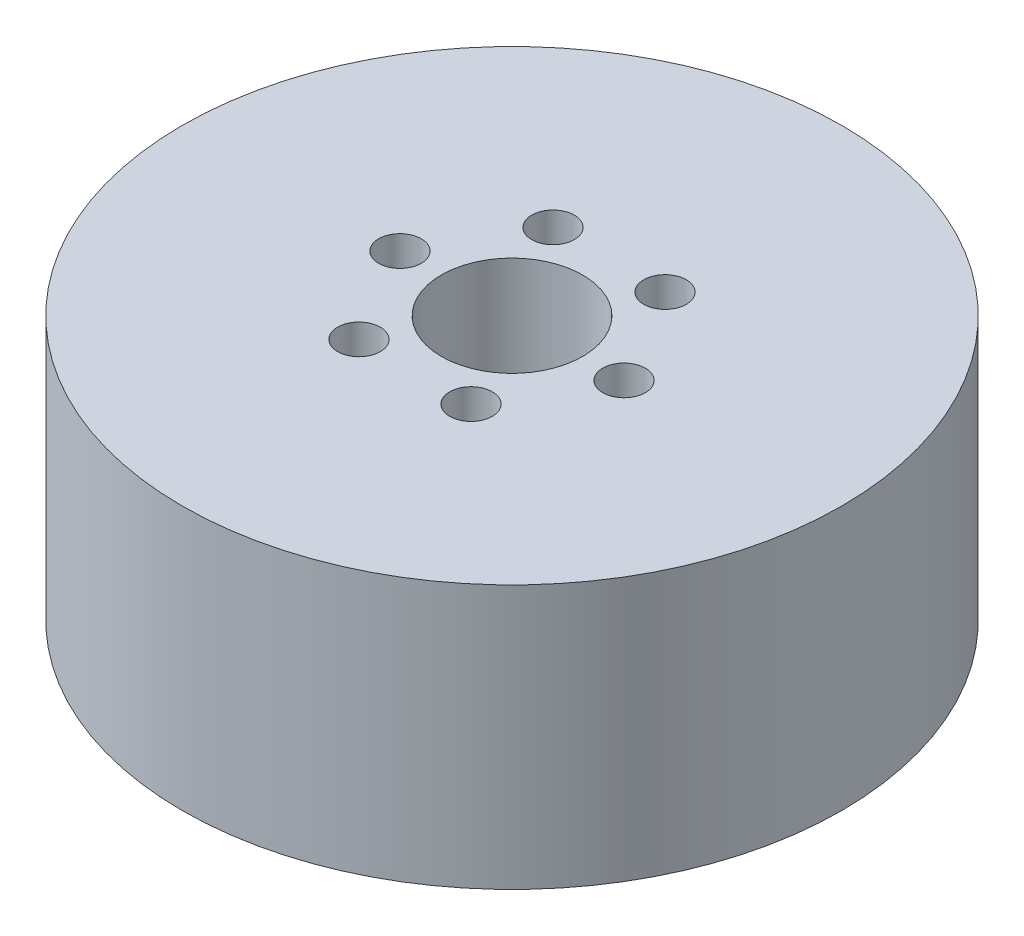
ISO-10303-21;
HEADER;
FILE_DESCRIPTION(('STEP AP214'),'2;1');
FILE_NAME('part.step','',(''),(''),'','','');
FILE_SCHEMA(('AUTOMOTIVE_DESIGN { 1 0 10303 214 1 1 1 1 }'));
ENDSEC;
DATA;
#1=APPLICATION_CONTEXT('core data for automotive mechanical design processes');
#2=APPLICATION_PROTOCOL_DEFINITION('international standard','automotive_design',2000,#1);
#3=PRODUCT_CONTEXT('',#1,'mechanical');
#4=PRODUCT('Part','Part','',(#3));
#5=PRODUCT_RELATED_PRODUCT_CATEGORY('part','',(#4));
#6=PRODUCT_DEFINITION_FORMATION('','',#4);
#7=PRODUCT_DEFINITION_CONTEXT('part definition',#1,'design');
#8=PRODUCT_DEFINITION('design','',#6,#7);
#9=PRODUCT_DEFINITION_SHAPE('','',#8);
#10=(LENGTH_UNIT() NAMED_UNIT(*) SI_UNIT(.MILLI.,.METRE.));
#11=(NAMED_UNIT(*) PLANE_ANGLE_UNIT() SI_UNIT($,.RADIAN.));
#12=(NAMED_UNIT(*) SI_UNIT($,.STERADIAN.) SOLID_ANGLE_UNIT());
#13=UNCERTAINTY_MEASURE_WITH_UNIT(LENGTH_MEASURE(1.E-05),#10,'distance_accuracy_value','');
#14=(GEOMETRIC_REPRESENTATION_CONTEXT(3) GLOBAL_UNCERTAINTY_ASSIGNED_CONTEXT((#13)) GLOBAL_UNIT_ASSIGNED_CONTEXT((#10,
#11,#12)) REPRESENTATION_CONTEXT('',''));
#15=CARTESIAN_POINT('',(0.,0.,0.));
#16=DIRECTION('',(0.,0.,1.));
#17=DIRECTION('',(1.,0.,0.));
#18=AXIS2_PLACEMENT_3D('',#15,#16,#17);
#19=CARTESIAN_POINT('',(0.,28.,0.));
#20=DIRECTION('',(0.,-1.,0.));
#21=DIRECTION('',(0.,0.,-1.));
#22=AXIS2_PLACEMENT_3D('',#19,#20,#21);
#23=CYLINDRICAL_SURFACE('',#22,35.);
#24=CARTESIAN_POINT('',(0.,28.,0.));
#25=DIRECTION('',(0.,1.,0.));
#26=DIRECTION('',(0.,0.,1.));
#27=AXIS2_PLACEMENT_3D('',#24,#25,#26);
#28=CIRCLE('',#27,35.);
#29=CARTESIAN_POINT('',(0.,28.,35.));
#30=VERTEX_POINT('',#29);
#31=EDGE_CURVE('E10',#30,#30,#28,.T.);
#32=ORIENTED_EDGE('',*,*,#31,.F.);
#33=EDGE_LOOP('',(#32));
#34=FACE_BOUND('',#33,.T.);
#35=CARTESIAN_POINT('',(0.,0.,0.));
#36=DIRECTION('',(0.,1.,0.));
#37=DIRECTION('',(0.,0.,1.));
#38=AXIS2_PLACEMENT_3D('',#35,#36,#37);
#39=CIRCLE('',#38,35.);
#40=CARTESIAN_POINT('',(0.,0.,35.));
#41=VERTEX_POINT('',#40);
#42=EDGE_CURVE('E37',#41,#41,#39,.T.);
#43=ORIENTED_EDGE('',*,*,#42,.T.);
#44=EDGE_LOOP('',(#43));
#45=FACE_BOUND('',#44,.T.);
#46=ADVANCED_FACE('F40',(#34,#45),#23,.T.);
#47=CARTESIAN_POINT('',(0.,28.,0.));
#48=DIRECTION('',(0.,1.,0.));
#49=DIRECTION('',(0.,0.,1.));
#50=AXIS2_PLACEMENT_3D('',#47,#48,#49);
#51=PLANE('',#50);
#52=CARTESIAN_POINT('',(-5.94638625213495,28.,-10.2994431101265));
#53=DIRECTION('',(0.,1.,0.));
#54=DIRECTION('',(-0.866025403784433,0.,0.50000000000001));
#55=AXIS2_PLACEMENT_3D('',#52,#53,#54);
#56=CIRCLE('',#55,2.26116094121226);
#57=CARTESIAN_POINT('',(-5.94638625213495,28.,-8.03828216891428));
#58=VERTEX_POINT('',#57);
#59=EDGE_CURVE('E70',#58,#58,#56,.T.);
#60=ORIENTED_EDGE('',*,*,#59,.F.);
#61=EDGE_LOOP('',(#60));
#62=FACE_BOUND('',#61,.T.);
#63=CARTESIAN_POINT('',(5.94638625213474,28.,-10.2994431101267));
#64=DIRECTION('',(0.,1.,0.));
#65=DIRECTION('',(-0.866025403784443,0.,-0.499999999999992));
#66=AXIS2_PLACEMENT_3D('',#63,#64,#65);
#67=CIRCLE('',#66,2.26116094121226);
#68=CARTESIAN_POINT('',(5.94638625213474,28.,-8.0382821689144));
#69=VERTEX_POINT('',#68);
#70=EDGE_CURVE('E71',#69,#69,#67,.T.);
#71=ORIENTED_EDGE('',*,*,#70,.F.);
#72=EDGE_LOOP('',(#71));
#73=FACE_BOUND('',#72,.T.);
#74=CARTESIAN_POINT('',(11.8927725042697,28.,0.));
#75=DIRECTION('',(0.,1.,0.));
#76=DIRECTION('',(0.,0.,-1.));
#77=AXIS2_PLACEMENT_3D('',#74,#75,#76);
#78=CIRCLE('',#77,2.26116094121226);
#79=CARTESIAN_POINT('',(11.8927725042697,28.,2.26116094121226));
#80=VERTEX_POINT('',#79);
#81=EDGE_CURVE('E78',#80,#80,#78,.T.);
#82=ORIENTED_EDGE('',*,*,#81,.F.);
#83=EDGE_LOOP('',(#82));
#84=FACE_BOUND('',#83,.T.);
#85=CARTESIAN_POINT('',(5.94638625213488,28.,10.2994431101266));
#86=DIRECTION('',(0.,1.,0.));
#87=DIRECTION('',(0.866025403784436,0.,-0.500000000000004));
#88=AXIS2_PLACEMENT_3D('',#85,#86,#87);
#89=CIRCLE('',#88,2.26116094121226);
#90=CARTESIAN_POINT('',(5.94638625213488,28.,12.5606040513388));
#91=VERTEX_POINT('',#90);
#92=EDGE_CURVE('E84',#91,#91,#89,.T.);
#93=ORIENTED_EDGE('',*,*,#92,.F.);
#94=EDGE_LOOP('',(#93));
#95=FACE_BOUND('',#94,.T.);
#96=CARTESIAN_POINT('',(-5.94638625213481,28.,10.2994431101266));
#97=DIRECTION('',(0.,1.,0.));
#98=DIRECTION('',(0.86602540378444,0.,0.499999999999998));
#99=AXIS2_PLACEMENT_3D('',#96,#97,#98);
#100=CIRCLE('',#99,2.26116094121226);
#101=CARTESIAN_POINT('',(-5.94638625213481,28.,12.5606040513389));
#102=VERTEX_POINT('',#101);
#103=EDGE_CURVE('E61',#102,#102,#100,.T.);
#104=ORIENTED_EDGE('',*,*,#103,.F.);
#105=EDGE_LOOP('',(#104));
#106=FACE_BOUND('',#105,.T.);
#107=CARTESIAN_POINT('',(-11.8927725042697,28.,0.));
#108=DIRECTION('',(0.,1.,0.));
#109=DIRECTION('',(0.,0.,1.));
#110=AXIS2_PLACEMENT_3D('',#107,#108,#109);
#111=CIRCLE('',#110,2.26116094121226);
#112=CARTESIAN_POINT('',(-11.8927725042697,28.,2.26116094121226));
#113=VERTEX_POINT('',#112);
#114=EDGE_CURVE('E54',#113,#113,#111,.T.);
#115=ORIENTED_EDGE('',*,*,#114,.F.);
#116=EDGE_LOOP('',(#115));
#117=FACE_BOUND('',#116,.T.);
#118=CARTESIAN_POINT('',(0.,28.,0.));
#119=DIRECTION('',(0.,1.,0.));
#120=DIRECTION('',(0.,0.,1.));
#121=AXIS2_PLACEMENT_3D('',#118,#119,#120);
#122=CIRCLE('',#121,7.5);
#123=CARTESIAN_POINT('',(0.,28.,7.5));
#124=VERTEX_POINT('',#123);
#125=EDGE_CURVE('E50',#124,#124,#122,.T.);
#126=ORIENTED_EDGE('',*,*,#125,.F.);
#127=EDGE_LOOP('',(#126));
#128=FACE_BOUND('',#127,.T.);
#129=ORIENTED_EDGE('',*,*,#31,.T.);
#130=EDGE_LOOP('',(#129));
#131=FACE_BOUND('',#130,.T.);
#132=ADVANCED_FACE('F99',(#62,#73,#84,#95,#106,#117,#128,#131),#51,.T.);
#133=CARTESIAN_POINT('',(0.,0.,0.));
#134=DIRECTION('',(0.,1.,0.));
#135=DIRECTION('',(0.,0.,1.));
#136=AXIS2_PLACEMENT_3D('',#133,#134,#135);
#137=PLANE('',#136);
#138=CARTESIAN_POINT('',(0.,0.,0.));
#139=DIRECTION('',(0.,1.,0.));
#140=DIRECTION('',(0.,0.,1.));
#141=AXIS2_PLACEMENT_3D('',#138,#139,#140);
#142=CIRCLE('',#141,7.5);
#143=CARTESIAN_POINT('',(0.,0.,7.5));
#144=VERTEX_POINT('',#143);
#145=EDGE_CURVE('E47',#144,#144,#142,.T.);
#146=ORIENTED_EDGE('',*,*,#145,.T.);
#147=EDGE_LOOP('',(#146));
#148=FACE_BOUND('',#147,.T.);
#149=ORIENTED_EDGE('',*,*,#42,.F.);
#150=EDGE_LOOP('',(#149));
#151=FACE_BOUND('',#150,.T.);
#152=ADVANCED_FACE('F103',(#148,#151),#137,.F.);
#153=CARTESIAN_POINT('',(0.,28.,0.));
#154=DIRECTION('',(0.,-1.,0.));
#155=DIRECTION('',(0.,0.,-1.));
#156=AXIS2_PLACEMENT_3D('',#153,#154,#155);
#157=CYLINDRICAL_SURFACE('',#156,7.5);
#158=ORIENTED_EDGE('',*,*,#125,.T.);
#159=EDGE_LOOP('',(#158));
#160=FACE_BOUND('',#159,.T.);
#161=ORIENTED_EDGE('',*,*,#145,.F.);
#162=EDGE_LOOP('',(#161));
#163=FACE_BOUND('',#162,.T.);
#164=ADVANCED_FACE('F115',(#160,#163),#157,.F.);
#165=CARTESIAN_POINT('',(-11.8927725042697,1.96096125977103,0.));
#166=DIRECTION('',(0.,1.,0.));
#167=DIRECTION('',(0.,0.,1.));
#168=AXIS2_PLACEMENT_3D('',#165,#166,#167);
#169=CYLINDRICAL_SURFACE('',#168,2.26116094121226);
#170=CARTESIAN_POINT('',(-11.8927725042697,1.96096125977103,0.));
#171=DIRECTION('',(0.,1.,0.));
#172=DIRECTION('',(0.,0.,1.));
#173=AXIS2_PLACEMENT_3D('',#170,#171,#172);
#174=CIRCLE('',#173,2.26116094121226);
#175=CARTESIAN_POINT('',(-11.8927725042697,1.96096125977103,2.26116094121226));
#176=VERTEX_POINT('',#175);
#177=EDGE_CURVE('E55',#176,#176,#174,.T.);
#178=CARTESIAN_POINT('',(-11.8927725042697,1.96096125977103,2.26116094121226));
#179=CARTESIAN_POINT('',(-11.8927725042697,2.23220124664842,2.26116094121226));
#180=CARTESIAN_POINT('',(-11.8927725042697,2.5034412335258,2.26116094121226));
#181=CARTESIAN_POINT('',(-11.8927725042697,3.04592120728057,2.26116094121226));
#182=CARTESIAN_POINT('',(-11.8927725042697,3.31716119415796,2.26116094121226));
#183=CARTESIAN_POINT('',(-11.8927725042697,3.85964116791273,2.26116094121226));
#184=CARTESIAN_POINT('',(-11.8927725042697,4.13088115479011,2.26116094121226));
#185=CARTESIAN_POINT('',(-11.8927725042697,4.67336112854488,2.26116094121226));
#186=CARTESIAN_POINT('',(-11.8927725042697,4.94460111542227,2.26116094121226));
#187=CARTESIAN_POINT('',(-11.8927725042697,5.48708108917704,2.26116094121226));
#188=CARTESIAN_POINT('',(-11.8927725042697,5.75832107605442,2.26116094121226));
#189=CARTESIAN_POINT('',(-11.8927725042697,6.30080104980919,2.26116094121226));
#190=CARTESIAN_POINT('',(-11.8927725042697,6.57204103668658,2.26116094121226));
#191=CARTESIAN_POINT('',(-11.8927725042697,7.11452101044135,2.26116094121226));
#192=CARTESIAN_POINT('',(-11.8927725042697,7.38576099731873,2.26116094121226));
#193=CARTESIAN_POINT('',(-11.8927725042697,7.9282409710735,2.26116094121226));
#194=CARTESIAN_POINT('',(-11.8927725042697,8.19948095795089,2.26116094121226));
#195=CARTESIAN_POINT('',(-11.8927725042697,8.74196093170566,2.26116094121226));
#196=CARTESIAN_POINT('',(-11.8927725042697,9.01320091858304,2.26116094121226));
#197=CARTESIAN_POINT('',(-11.8927725042697,9.55568089233781,2.26116094121226));
#198=CARTESIAN_POINT('',(-11.8927725042697,9.8269208792152,2.26116094121226));
#199=CARTESIAN_POINT('',(-11.8927725042697,10.36940085297,2.26116094121226));
#200=CARTESIAN_POINT('',(-11.8927725042697,10.6406408398474,2.26116094121226));
#201=CARTESIAN_POINT('',(-11.8927725042697,11.1831208136021,2.26116094121226));
#202=CARTESIAN_POINT('',(-11.8927725042697,11.4543608004795,2.26116094121226));
#203=CARTESIAN_POINT('',(-11.8927725042697,11.9968407742343,2.26116094121226));
#204=CARTESIAN_POINT('',(-11.8927725042697,12.2680807611117,2.26116094121226));
#205=CARTESIAN_POINT('',(-11.8927725042697,12.8105607348664,2.26116094121226));
#206=CARTESIAN_POINT('',(-11.8927725042697,13.0818007217438,2.26116094121226));
#207=CARTESIAN_POINT('',(-11.8927725042697,13.6242806954986,2.26116094121226));
#208=CARTESIAN_POINT('',(-11.8927725042697,13.895520682376,2.26116094121226));
#209=CARTESIAN_POINT('',(-11.8927725042697,14.4380006561307,2.26116094121226));
#210=CARTESIAN_POINT('',(-11.8927725042697,14.7092406430081,2.26116094121226));
#211=CARTESIAN_POINT('',(-11.8927725042697,15.2517206167629,2.26116094121226));
#212=CARTESIAN_POINT('',(-11.8927725042697,15.5229606036403,2.26116094121226));
#213=CARTESIAN_POINT('',(-11.8927725042697,16.0654405773951,2.26116094121226));
#214=CARTESIAN_POINT('',(-11.8927725042697,16.3366805642724,2.26116094121226));
#215=CARTESIAN_POINT('',(-11.8927725042697,16.8791605380272,2.26116094121226));
#216=CARTESIAN_POINT('',(-11.8927725042697,17.1504005249046,2.26116094121226));
#217=CARTESIAN_POINT('',(-11.8927725042697,17.6928804986594,2.26116094121226));
#218=CARTESIAN_POINT('',(-11.8927725042697,17.9641204855367,2.26116094121226));
#219=CARTESIAN_POINT('',(-11.8927725042697,18.5066004592915,2.26116094121226));
#220=CARTESIAN_POINT('',(-11.8927725042697,18.7778404461689,2.26116094121226));
#221=CARTESIAN_POINT('',(-11.8927725042697,19.3203204199237,2.26116094121226));
#222=CARTESIAN_POINT('',(-11.8927725042697,19.5915604068011,2.26116094121226));
#223=CARTESIAN_POINT('',(-11.8927725042697,20.1340403805558,2.26116094121226));
#224=CARTESIAN_POINT('',(-11.8927725042697,20.4052803674332,2.26116094121226));
#225=CARTESIAN_POINT('',(-11.8927725042697,20.947760341188,2.26116094121226));
#226=CARTESIAN_POINT('',(-11.8927725042697,21.2190003280654,2.26116094121226));
#227=CARTESIAN_POINT('',(-11.8927725042697,21.7614803018201,2.26116094121226));
#228=CARTESIAN_POINT('',(-11.8927725042697,22.0327202886975,2.26116094121226));
#229=CARTESIAN_POINT('',(-11.8927725042697,22.5752002624523,2.26116094121226));
#230=CARTESIAN_POINT('',(-11.8927725042697,22.8464402493297,2.26116094121226));
#231=CARTESIAN_POINT('',(-11.8927725042697,23.3889202230845,2.26116094121226));
#232=CARTESIAN_POINT('',(-11.8927725042697,23.6601602099618,2.26116094121226));
#233=CARTESIAN_POINT('',(-11.8927725042697,24.2026401837166,2.26116094121226));
#234=CARTESIAN_POINT('',(-11.8927725042697,24.473880170594,2.26116094121226));
#235=CARTESIAN_POINT('',(-11.8927725042697,25.0163601443488,2.26116094121226));
#236=CARTESIAN_POINT('',(-11.8927725042697,25.2876001312261,2.26116094121226));
#237=CARTESIAN_POINT('',(-11.8927725042697,25.8300801049809,2.26116094121226));
#238=CARTESIAN_POINT('',(-11.8927725042697,26.1013200918583,2.26116094121226));
#239=CARTESIAN_POINT('',(-11.8927725042697,26.6438000656131,2.26116094121226));
#240=CARTESIAN_POINT('',(-11.8927725042697,26.9150400524905,2.26116094121226));
#241=CARTESIAN_POINT('',(-11.8927725042697,27.4575200262452,2.26116094121226));
#242=CARTESIAN_POINT('',(-11.8927725042697,27.7287600131226,2.26116094121226));
#243=CARTESIAN_POINT('',(-11.8927725042697,28.,2.26116094121226));
#244=B_SPLINE_CURVE_WITH_KNOTS('',3,(#178,#179,#180,#181,#182,#183,#184,#185,#186,#187,#188,
#189,#190,#191,#192,#193,#194,#195,#196,#197,#198,#199,#200,#201,#202,#203,#204,#205,#206,#207,
#208,#209,#210,#211,#212,#213,#214,#215,#216,#217,#218,#219,#220,#221,#222,#223,#224,#225,#226,
#227,#228,#229,#230,#231,#232,#233,#234,#235,#236,#237,#238,#239,#240,#241,#242,#243),
.UNSPECIFIED.,.F.,.F.,(4,2,2,2,2,2,2,2,2,2,2,2,2,2,2,2,2,2,2,2,2,2,2,2,2,2,2,2,2,2,2,2,4),(0.,
0.813719960632155,1.62743992126431,2.44115988189647,3.25487984252862,4.06859980316078,
4.88231976379293,5.69603972442509,6.50975968505724,7.3234796456894,8.13719960632155,
8.95091956695371,9.76463952758586,10.578359488218,11.3920794488502,12.2057994094823,
13.0195193701145,13.8332393307466,14.6469592913788,15.4606792520109,16.2743992126431,
17.0881191732753,17.9018391339074,18.7155590945396,19.5292790551717,20.3429990158039,
21.156718976436,21.9704389370682,22.7841588977003,23.5978788583325,24.4115988189647,
25.2253187795968,26.039038740229),.UNSPECIFIED.);
#245=EDGE_CURVE('BSEAM113',#176,#113,#244,.T.);
#246=ORIENTED_EDGE('',*,*,#177,.F.);
#247=ORIENTED_EDGE('',*,*,#114,.T.);
#248=ORIENTED_EDGE('',*,*,#245,.T.);
#249=ORIENTED_EDGE('',*,*,#245,.F.);
#250=EDGE_LOOP('',(#246,#248,#247,#249));
#251=FACE_BOUND('',#250,.T.);
#252=ADVANCED_FACE('F113',(#251),#169,.F.);
#253=CARTESIAN_POINT('',(-11.8927725042697,1.96096125977103,0.));
#254=DIRECTION('',(0.,1.,0.));
#255=DIRECTION('',(0.,0.,1.));
#256=AXIS2_PLACEMENT_3D('',#253,#254,#255);
#257=PLANE('',#256);
#258=ORIENTED_EDGE('',*,*,#177,.T.);
#259=EDGE_LOOP('',(#258));
#260=FACE_BOUND('',#259,.T.);
#261=ADVANCED_FACE('F144',(#260),#257,.T.);
#262=CARTESIAN_POINT('',(-5.94638625213481,1.96096125977103,10.2994431101266));
#263=DIRECTION('',(0.,1.,0.));
#264=DIRECTION('',(0.,0.,1.));
#265=AXIS2_PLACEMENT_3D('',#262,#263,#264);
#266=CYLINDRICAL_SURFACE('',#265,2.26116094121226);
#267=CARTESIAN_POINT('',(-5.94638625213481,1.96096125977103,10.2994431101266));
#268=DIRECTION('',(0.,1.,0.));
#269=DIRECTION('',(0.86602540378444,0.,0.499999999999998));
#270=AXIS2_PLACEMENT_3D('',#267,#268,#269);
#271=CIRCLE('',#270,2.26116094121226);
#272=CARTESIAN_POINT('',(-5.94638625213481,1.96096125977103,12.5606040513389));
#273=VERTEX_POINT('',#272);
#274=EDGE_CURVE('E59',#273,#273,#271,.T.);
#275=CARTESIAN_POINT('',(-5.94638625213481,1.96096125977103,12.5606040513389));
#276=CARTESIAN_POINT('',(-5.94638625213481,2.23220124664842,12.5606040513389));
#277=CARTESIAN_POINT('',(-5.94638625213481,2.5034412335258,12.5606040513389));
#278=CARTESIAN_POINT('',(-5.94638625213481,3.04592120728057,12.5606040513389));
#279=CARTESIAN_POINT('',(-5.94638625213481,3.31716119415796,12.5606040513389));
#280=CARTESIAN_POINT('',(-5.94638625213481,3.85964116791273,12.5606040513389));
#281=CARTESIAN_POINT('',(-5.94638625213481,4.13088115479011,12.5606040513389));
#282=CARTESIAN_POINT('',(-5.94638625213481,4.67336112854488,12.5606040513389));
#283=CARTESIAN_POINT('',(-5.94638625213481,4.94460111542227,12.5606040513389));
#284=CARTESIAN_POINT('',(-5.94638625213481,5.48708108917704,12.5606040513389));
#285=CARTESIAN_POINT('',(-5.94638625213481,5.75832107605442,12.5606040513389));
#286=CARTESIAN_POINT('',(-5.94638625213481,6.30080104980919,12.5606040513389));
#287=CARTESIAN_POINT('',(-5.94638625213481,6.57204103668658,12.5606040513389));
#288=CARTESIAN_POINT('',(-5.94638625213481,7.11452101044135,12.5606040513389));
#289=CARTESIAN_POINT('',(-5.94638625213481,7.38576099731873,12.5606040513389));
#290=CARTESIAN_POINT('',(-5.94638625213481,7.9282409710735,12.5606040513389));
#291=CARTESIAN_POINT('',(-5.94638625213481,8.19948095795089,12.5606040513389));
#292=CARTESIAN_POINT('',(-5.94638625213481,8.74196093170566,12.5606040513389));
#293=CARTESIAN_POINT('',(-5.94638625213481,9.01320091858304,12.5606040513389));
#294=CARTESIAN_POINT('',(-5.94638625213481,9.55568089233781,12.5606040513389));
#295=CARTESIAN_POINT('',(-5.94638625213481,9.8269208792152,12.5606040513389));
#296=CARTESIAN_POINT('',(-5.94638625213481,10.36940085297,12.5606040513389));
#297=CARTESIAN_POINT('',(-5.94638625213481,10.6406408398474,12.5606040513389));
#298=CARTESIAN_POINT('',(-5.94638625213481,11.1831208136021,12.5606040513389));
#299=CARTESIAN_POINT('',(-5.94638625213481,11.4543608004795,12.5606040513389));
#300=CARTESIAN_POINT('',(-5.94638625213481,11.9968407742343,12.5606040513389));
#301=CARTESIAN_POINT('',(-5.94638625213481,12.2680807611117,12.5606040513389));
#302=CARTESIAN_POINT('',(-5.94638625213481,12.8105607348664,12.5606040513389));
#303=CARTESIAN_POINT('',(-5.94638625213481,13.0818007217438,12.5606040513389));
#304=CARTESIAN_POINT('',(-5.94638625213481,13.6242806954986,12.5606040513389));
#305=CARTESIAN_POINT('',(-5.94638625213481,13.895520682376,12.5606040513389));
#306=CARTESIAN_POINT('',(-5.94638625213481,14.4380006561307,12.5606040513389));
#307=CARTESIAN_POINT('',(-5.94638625213481,14.7092406430081,12.5606040513389));
#308=CARTESIAN_POINT('',(-5.94638625213481,15.2517206167629,12.5606040513389));
#309=CARTESIAN_POINT('',(-5.94638625213481,15.5229606036403,12.5606040513389));
#310=CARTESIAN_POINT('',(-5.94638625213481,16.0654405773951,12.5606040513389));
#311=CARTESIAN_POINT('',(-5.94638625213481,16.3366805642724,12.5606040513389));
#312=CARTESIAN_POINT('',(-5.94638625213481,16.8791605380272,12.5606040513389));
#313=CARTESIAN_POINT('',(-5.94638625213481,17.1504005249046,12.5606040513389));
#314=CARTESIAN_POINT('',(-5.94638625213481,17.6928804986594,12.5606040513389));
#315=CARTESIAN_POINT('',(-5.94638625213481,17.9641204855367,12.5606040513389));
#316=CARTESIAN_POINT('',(-5.94638625213481,18.5066004592915,12.5606040513389));
#317=CARTESIAN_POINT('',(-5.94638625213481,18.7778404461689,12.5606040513389));
#318=CARTESIAN_POINT('',(-5.94638625213481,19.3203204199237,12.5606040513389));
#319=CARTESIAN_POINT('',(-5.94638625213481,19.5915604068011,12.5606040513389));
#320=CARTESIAN_POINT('',(-5.94638625213481,20.1340403805558,12.5606040513389));
#321=CARTESIAN_POINT('',(-5.94638625213481,20.4052803674332,12.5606040513389));
#322=CARTESIAN_POINT('',(-5.94638625213481,20.947760341188,12.5606040513389));
#323=CARTESIAN_POINT('',(-5.94638625213481,21.2190003280654,12.5606040513389));
#324=CARTESIAN_POINT('',(-5.94638625213481,21.7614803018201,12.5606040513389));
#325=CARTESIAN_POINT('',(-5.94638625213481,22.0327202886975,12.5606040513389));
#326=CARTESIAN_POINT('',(-5.94638625213481,22.5752002624523,12.5606040513389));
#327=CARTESIAN_POINT('',(-5.94638625213481,22.8464402493297,12.5606040513389));
#328=CARTESIAN_POINT('',(-5.94638625213481,23.3889202230845,12.5606040513389));
#329=CARTESIAN_POINT('',(-5.94638625213481,23.6601602099618,12.5606040513389));
#330=CARTESIAN_POINT('',(-5.94638625213481,24.2026401837166,12.5606040513389));
#331=CARTESIAN_POINT('',(-5.94638625213481,24.473880170594,12.5606040513389));
#332=CARTESIAN_POINT('',(-5.94638625213481,25.0163601443488,12.5606040513389));
#333=CARTESIAN_POINT('',(-5.94638625213481,25.2876001312261,12.5606040513389));
#334=CARTESIAN_POINT('',(-5.94638625213481,25.8300801049809,12.5606040513389));
#335=CARTESIAN_POINT('',(-5.94638625213481,26.1013200918583,12.5606040513389));
#336=CARTESIAN_POINT('',(-5.94638625213481,26.6438000656131,12.5606040513389));
#337=CARTESIAN_POINT('',(-5.94638625213481,26.9150400524905,12.5606040513389));
#338=CARTESIAN_POINT('',(-5.94638625213481,27.4575200262452,12.5606040513389));
#339=CARTESIAN_POINT('',(-5.94638625213481,27.7287600131226,12.5606040513389));
#340=CARTESIAN_POINT('',(-5.94638625213481,28.,12.5606040513389));
#341=B_SPLINE_CURVE_WITH_KNOTS('',3,(#275,#276,#277,#278,#279,#280,#281,#282,#283,#284,#285,
#286,#287,#288,#289,#290,#291,#292,#293,#294,#295,#296,#297,#298,#299,#300,#301,#302,#303,#304,
#305,#306,#307,#308,#309,#310,#311,#312,#313,#314,#315,#316,#317,#318,#319,#320,#321,#322,#323,
#324,#325,#326,#327,#328,#329,#330,#331,#332,#333,#334,#335,#336,#337,#338,#339,#340),
.UNSPECIFIED.,.F.,.F.,(4,2,2,2,2,2,2,2,2,2,2,2,2,2,2,2,2,2,2,2,2,2,2,2,2,2,2,2,2,2,2,2,4),(0.,
0.813719960632155,1.62743992126431,2.44115988189647,3.25487984252862,4.06859980316078,
4.88231976379293,5.69603972442509,6.50975968505724,7.3234796456894,8.13719960632155,
8.95091956695371,9.76463952758586,10.578359488218,11.3920794488502,12.2057994094823,
13.0195193701145,13.8332393307466,14.6469592913788,15.4606792520109,16.2743992126431,
17.0881191732753,17.9018391339074,18.7155590945396,19.5292790551717,20.3429990158039,
21.156718976436,21.9704389370682,22.7841588977003,23.5978788583325,24.4115988189647,
25.2253187795968,26.039038740229),.UNSPECIFIED.);
#342=EDGE_CURVE('BSEAM153',#273,#102,#341,.T.);
#343=ORIENTED_EDGE('',*,*,#274,.F.);
#344=ORIENTED_EDGE('',*,*,#103,.T.);
#345=ORIENTED_EDGE('',*,*,#342,.T.);
#346=ORIENTED_EDGE('',*,*,#342,.F.);
#347=EDGE_LOOP('',(#343,#345,#344,#346));
#348=FACE_BOUND('',#347,.T.);
#349=ADVANCED_FACE('F153',(#348),#266,.F.);
#350=CARTESIAN_POINT('',(-5.94638625213481,1.96096125977103,10.2994431101266));
#351=DIRECTION('',(0.,1.,0.));
#352=DIRECTION('',(0.86602540378444,0.,0.499999999999998));
#353=AXIS2_PLACEMENT_3D('',#350,#351,#352);
#354=PLANE('',#353);
#355=ORIENTED_EDGE('',*,*,#274,.T.);
#356=EDGE_LOOP('',(#355));
#357=FACE_BOUND('',#356,.T.);
#358=ADVANCED_FACE('F96',(#357),#354,.T.);
#359=CARTESIAN_POINT('',(5.94638625213488,1.96096125977103,10.2994431101266));
#360=DIRECTION('',(0.,1.,0.));
#361=DIRECTION('',(0.,0.,1.));
#362=AXIS2_PLACEMENT_3D('',#359,#360,#361);
#363=CYLINDRICAL_SURFACE('',#362,2.26116094121226);
#364=CARTESIAN_POINT('',(5.94638625213488,1.96096125977103,10.2994431101266));
#365=DIRECTION('',(0.,1.,0.));
#366=DIRECTION('',(0.866025403784436,0.,-0.500000000000004));
#367=AXIS2_PLACEMENT_3D('',#364,#365,#366);
#368=CIRCLE('',#367,2.26116094121226);
#369=CARTESIAN_POINT('',(5.94638625213488,1.96096125977103,12.5606040513388));
#370=VERTEX_POINT('',#369);
#371=EDGE_CURVE('E63',#370,#370,#368,.T.);
#372=CARTESIAN_POINT('',(5.94638625213488,1.96096125977103,12.5606040513388));
#373=CARTESIAN_POINT('',(5.94638625213488,2.23220124664842,12.5606040513388));
#374=CARTESIAN_POINT('',(5.94638625213488,2.5034412335258,12.5606040513388));
#375=CARTESIAN_POINT('',(5.94638625213488,3.04592120728057,12.5606040513388));
#376=CARTESIAN_POINT('',(5.94638625213488,3.31716119415796,12.5606040513388));
#377=CARTESIAN_POINT('',(5.94638625213488,3.85964116791273,12.5606040513388));
#378=CARTESIAN_POINT('',(5.94638625213488,4.13088115479011,12.5606040513388));
#379=CARTESIAN_POINT('',(5.94638625213488,4.67336112854488,12.5606040513388));
#380=CARTESIAN_POINT('',(5.94638625213488,4.94460111542227,12.5606040513388));
#381=CARTESIAN_POINT('',(5.94638625213488,5.48708108917704,12.5606040513388));
#382=CARTESIAN_POINT('',(5.94638625213488,5.75832107605442,12.5606040513388));
#383=CARTESIAN_POINT('',(5.94638625213488,6.30080104980919,12.5606040513388));
#384=CARTESIAN_POINT('',(5.94638625213488,6.57204103668658,12.5606040513388));
#385=CARTESIAN_POINT('',(5.94638625213488,7.11452101044135,12.5606040513388));
#386=CARTESIAN_POINT('',(5.94638625213488,7.38576099731873,12.5606040513388));
#387=CARTESIAN_POINT('',(5.94638625213488,7.9282409710735,12.5606040513388));
#388=CARTESIAN_POINT('',(5.94638625213488,8.19948095795089,12.5606040513388));
#389=CARTESIAN_POINT('',(5.94638625213488,8.74196093170566,12.5606040513388));
#390=CARTESIAN_POINT('',(5.94638625213488,9.01320091858304,12.5606040513388));
#391=CARTESIAN_POINT('',(5.94638625213488,9.55568089233781,12.5606040513388));
#392=CARTESIAN_POINT('',(5.94638625213488,9.8269208792152,12.5606040513388));
#393=CARTESIAN_POINT('',(5.94638625213488,10.36940085297,12.5606040513388));
#394=CARTESIAN_POINT('',(5.94638625213488,10.6406408398474,12.5606040513388));
#395=CARTESIAN_POINT('',(5.94638625213488,11.1831208136021,12.5606040513388));
#396=CARTESIAN_POINT('',(5.94638625213488,11.4543608004795,12.5606040513388));
#397=CARTESIAN_POINT('',(5.94638625213488,11.9968407742343,12.5606040513388));
#398=CARTESIAN_POINT('',(5.94638625213488,12.2680807611117,12.5606040513388));
#399=CARTESIAN_POINT('',(5.94638625213488,12.8105607348664,12.5606040513388));
#400=CARTESIAN_POINT('',(5.94638625213488,13.0818007217438,12.5606040513388));
#401=CARTESIAN_POINT('',(5.94638625213488,13.6242806954986,12.5606040513388));
#402=CARTESIAN_POINT('',(5.94638625213488,13.895520682376,12.5606040513388));
#403=CARTESIAN_POINT('',(5.94638625213488,14.4380006561307,12.5606040513388));
#404=CARTESIAN_POINT('',(5.94638625213488,14.7092406430081,12.5606040513388));
#405=CARTESIAN_POINT('',(5.94638625213488,15.2517206167629,12.5606040513388));
#406=CARTESIAN_POINT('',(5.94638625213488,15.5229606036403,12.5606040513388));
#407=CARTESIAN_POINT('',(5.94638625213488,16.0654405773951,12.5606040513388));
#408=CARTESIAN_POINT('',(5.94638625213488,16.3366805642724,12.5606040513388));
#409=CARTESIAN_POINT('',(5.94638625213488,16.8791605380272,12.5606040513388));
#410=CARTESIAN_POINT('',(5.94638625213488,17.1504005249046,12.5606040513388));
#411=CARTESIAN_POINT('',(5.94638625213488,17.6928804986594,12.5606040513388));
#412=CARTESIAN_POINT('',(5.94638625213488,17.9641204855367,12.5606040513388));
#413=CARTESIAN_POINT('',(5.94638625213488,18.5066004592915,12.5606040513388));
#414=CARTESIAN_POINT('',(5.94638625213488,18.7778404461689,12.5606040513388));
#415=CARTESIAN_POINT('',(5.94638625213488,19.3203204199237,12.5606040513388));
#416=CARTESIAN_POINT('',(5.94638625213488,19.5915604068011,12.5606040513388));
#417=CARTESIAN_POINT('',(5.94638625213488,20.1340403805558,12.5606040513388));
#418=CARTESIAN_POINT('',(5.94638625213488,20.4052803674332,12.5606040513388));
#419=CARTESIAN_POINT('',(5.94638625213488,20.947760341188,12.5606040513388));
#420=CARTESIAN_POINT('',(5.94638625213488,21.2190003280654,12.5606040513388));
#421=CARTESIAN_POINT('',(5.94638625213488,21.7614803018201,12.5606040513388));
#422=CARTESIAN_POINT('',(5.94638625213488,22.0327202886975,12.5606040513388));
#423=CARTESIAN_POINT('',(5.94638625213488,22.5752002624523,12.5606040513388));
#424=CARTESIAN_POINT('',(5.94638625213488,22.8464402493297,12.5606040513388));
#425=CARTESIAN_POINT('',(5.94638625213488,23.3889202230845,12.5606040513388));
#426=CARTESIAN_POINT('',(5.94638625213488,23.6601602099618,12.5606040513388));
#427=CARTESIAN_POINT('',(5.94638625213488,24.2026401837166,12.5606040513388));
#428=CARTESIAN_POINT('',(5.94638625213488,24.473880170594,12.5606040513388));
#429=CARTESIAN_POINT('',(5.94638625213488,25.0163601443488,12.5606040513388));
#430=CARTESIAN_POINT('',(5.94638625213488,25.2876001312261,12.5606040513388));
#431=CARTESIAN_POINT('',(5.94638625213488,25.8300801049809,12.5606040513388));
#432=CARTESIAN_POINT('',(5.94638625213488,26.1013200918583,12.5606040513388));
#433=CARTESIAN_POINT('',(5.94638625213488,26.6438000656131,12.5606040513388));
#434=CARTESIAN_POINT('',(5.94638625213488,26.9150400524905,12.5606040513388));
#435=CARTESIAN_POINT('',(5.94638625213488,27.4575200262452,12.5606040513388));
#436=CARTESIAN_POINT('',(5.94638625213488,27.7287600131226,12.5606040513388));
#437=CARTESIAN_POINT('',(5.94638625213488,28.,12.5606040513388));
#438=B_SPLINE_CURVE_WITH_KNOTS('',3,(#372,#373,#374,#375,#376,#377,#378,#379,#380,#381,#382,
#383,#384,#385,#386,#387,#388,#389,#390,#391,#392,#393,#394,#395,#396,#397,#398,#399,#400,#401,
#402,#403,#404,#405,#406,#407,#408,#409,#410,#411,#412,#413,#414,#415,#416,#417,#418,#419,#420,
#421,#422,#423,#424,#425,#426,#427,#428,#429,#430,#431,#432,#433,#434,#435,#436,#437),
.UNSPECIFIED.,.F.,.F.,(4,2,2,2,2,2,2,2,2,2,2,2,2,2,2,2,2,2,2,2,2,2,2,2,2,2,2,2,2,2,2,2,4),(0.,
0.813719960632155,1.62743992126431,2.44115988189647,3.25487984252862,4.06859980316078,
4.88231976379293,5.69603972442509,6.50975968505724,7.3234796456894,8.13719960632155,
8.95091956695371,9.76463952758586,10.578359488218,11.3920794488502,12.2057994094823,
13.0195193701145,13.8332393307466,14.6469592913788,15.4606792520109,16.2743992126431,
17.0881191732753,17.9018391339074,18.7155590945396,19.5292790551717,20.3429990158039,
21.156718976436,21.9704389370682,22.7841588977003,23.5978788583325,24.4115988189647,
25.2253187795968,26.039038740229),.UNSPECIFIED.);
#439=EDGE_CURVE('BSEAM91',#370,#91,#438,.T.);
#440=ORIENTED_EDGE('',*,*,#371,.F.);
#441=ORIENTED_EDGE('',*,*,#92,.T.);
#442=ORIENTED_EDGE('',*,*,#439,.T.);
#443=ORIENTED_EDGE('',*,*,#439,.F.);
#444=EDGE_LOOP('',(#440,#442,#441,#443));
#445=FACE_BOUND('',#444,.T.);
#446=ADVANCED_FACE('F91',(#445),#363,.F.);
#447=CARTESIAN_POINT('',(5.94638625213488,1.96096125977103,10.2994431101266));
#448=DIRECTION('',(0.,1.,0.));
#449=DIRECTION('',(0.866025403784436,0.,-0.500000000000004));
#450=AXIS2_PLACEMENT_3D('',#447,#448,#449);
#451=PLANE('',#450);
#452=ORIENTED_EDGE('',*,*,#371,.T.);
#453=EDGE_LOOP('',(#452));
#454=FACE_BOUND('',#453,.T.);
#455=ADVANCED_FACE('F93',(#454),#451,.T.);
#456=CARTESIAN_POINT('',(11.8927725042697,1.96096125977103,0.));
#457=DIRECTION('',(0.,1.,0.));
#458=DIRECTION('',(0.,0.,1.));
#459=AXIS2_PLACEMENT_3D('',#456,#457,#458);
#460=CYLINDRICAL_SURFACE('',#459,2.26116094121226);
#461=CARTESIAN_POINT('',(11.8927725042697,1.96096125977103,0.));
#462=DIRECTION('',(0.,1.,0.));
#463=DIRECTION('',(0.,0.,-1.));
#464=AXIS2_PLACEMENT_3D('',#461,#462,#463);
#465=CIRCLE('',#464,2.26116094121226);
#466=CARTESIAN_POINT('',(11.8927725042697,1.96096125977103,2.26116094121226));
#467=VERTEX_POINT('',#466);
#468=EDGE_CURVE('E85',#467,#467,#465,.T.);
#469=CARTESIAN_POINT('',(11.8927725042697,1.96096125977103,2.26116094121226));
#470=CARTESIAN_POINT('',(11.8927725042697,2.23220124664842,2.26116094121226));
#471=CARTESIAN_POINT('',(11.8927725042697,2.5034412335258,2.26116094121226));
#472=CARTESIAN_POINT('',(11.8927725042697,3.04592120728057,2.26116094121226));
#473=CARTESIAN_POINT('',(11.8927725042697,3.31716119415796,2.26116094121226));
#474=CARTESIAN_POINT('',(11.8927725042697,3.85964116791273,2.26116094121226));
#475=CARTESIAN_POINT('',(11.8927725042697,4.13088115479011,2.26116094121226));
#476=CARTESIAN_POINT('',(11.8927725042697,4.67336112854488,2.26116094121226));
#477=CARTESIAN_POINT('',(11.8927725042697,4.94460111542227,2.26116094121226));
#478=CARTESIAN_POINT('',(11.8927725042697,5.48708108917704,2.26116094121226));
#479=CARTESIAN_POINT('',(11.8927725042697,5.75832107605442,2.26116094121226));
#480=CARTESIAN_POINT('',(11.8927725042697,6.30080104980919,2.26116094121226));
#481=CARTESIAN_POINT('',(11.8927725042697,6.57204103668658,2.26116094121226));
#482=CARTESIAN_POINT('',(11.8927725042697,7.11452101044135,2.26116094121226));
#483=CARTESIAN_POINT('',(11.8927725042697,7.38576099731873,2.26116094121226));
#484=CARTESIAN_POINT('',(11.8927725042697,7.9282409710735,2.26116094121226));
#485=CARTESIAN_POINT('',(11.8927725042697,8.19948095795089,2.26116094121226));
#486=CARTESIAN_POINT('',(11.8927725042697,8.74196093170566,2.26116094121226));
#487=CARTESIAN_POINT('',(11.8927725042697,9.01320091858304,2.26116094121226));
#488=CARTESIAN_POINT('',(11.8927725042697,9.55568089233781,2.26116094121226));
#489=CARTESIAN_POINT('',(11.8927725042697,9.8269208792152,2.26116094121226));
#490=CARTESIAN_POINT('',(11.8927725042697,10.36940085297,2.26116094121226));
#491=CARTESIAN_POINT('',(11.8927725042697,10.6406408398474,2.26116094121226));
#492=CARTESIAN_POINT('',(11.8927725042697,11.1831208136021,2.26116094121226));
#493=CARTESIAN_POINT('',(11.8927725042697,11.4543608004795,2.26116094121226));
#494=CARTESIAN_POINT('',(11.8927725042697,11.9968407742343,2.26116094121226));
#495=CARTESIAN_POINT('',(11.8927725042697,12.2680807611117,2.26116094121226));
#496=CARTESIAN_POINT('',(11.8927725042697,12.8105607348664,2.26116094121226));
#497=CARTESIAN_POINT('',(11.8927725042697,13.0818007217438,2.26116094121226));
#498=CARTESIAN_POINT('',(11.8927725042697,13.6242806954986,2.26116094121226));
#499=CARTESIAN_POINT('',(11.8927725042697,13.895520682376,2.26116094121226));
#500=CARTESIAN_POINT('',(11.8927725042697,14.4380006561307,2.26116094121226));
#501=CARTESIAN_POINT('',(11.8927725042697,14.7092406430081,2.26116094121226));
#502=CARTESIAN_POINT('',(11.8927725042697,15.2517206167629,2.26116094121226));
#503=CARTESIAN_POINT('',(11.8927725042697,15.5229606036403,2.26116094121226));
#504=CARTESIAN_POINT('',(11.8927725042697,16.0654405773951,2.26116094121226));
#505=CARTESIAN_POINT('',(11.8927725042697,16.3366805642724,2.26116094121226));
#506=CARTESIAN_POINT('',(11.8927725042697,16.8791605380272,2.26116094121226));
#507=CARTESIAN_POINT('',(11.8927725042697,17.1504005249046,2.26116094121226));
#508=CARTESIAN_POINT('',(11.8927725042697,17.6928804986594,2.26116094121226));
#509=CARTESIAN_POINT('',(11.8927725042697,17.9641204855367,2.26116094121226));
#510=CARTESIAN_POINT('',(11.8927725042697,18.5066004592915,2.26116094121226));
#511=CARTESIAN_POINT('',(11.8927725042697,18.7778404461689,2.26116094121226));
#512=CARTESIAN_POINT('',(11.8927725042697,19.3203204199237,2.26116094121226));
#513=CARTESIAN_POINT('',(11.8927725042697,19.5915604068011,2.26116094121226));
#514=CARTESIAN_POINT('',(11.8927725042697,20.1340403805558,2.26116094121226));
#515=CARTESIAN_POINT('',(11.8927725042697,20.4052803674332,2.26116094121226));
#516=CARTESIAN_POINT('',(11.8927725042697,20.947760341188,2.26116094121226));
#517=CARTESIAN_POINT('',(11.8927725042697,21.2190003280654,2.26116094121226));
#518=CARTESIAN_POINT('',(11.8927725042697,21.7614803018201,2.26116094121226));
#519=CARTESIAN_POINT('',(11.8927725042697,22.0327202886975,2.26116094121226));
#520=CARTESIAN_POINT('',(11.8927725042697,22.5752002624523,2.26116094121226));
#521=CARTESIAN_POINT('',(11.8927725042697,22.8464402493297,2.26116094121226));
#522=CARTESIAN_POINT('',(11.8927725042697,23.3889202230845,2.26116094121226));
#523=CARTESIAN_POINT('',(11.8927725042697,23.6601602099618,2.26116094121226));
#524=CARTESIAN_POINT('',(11.8927725042697,24.2026401837166,2.26116094121226));
#525=CARTESIAN_POINT('',(11.8927725042697,24.473880170594,2.26116094121226));
#526=CARTESIAN_POINT('',(11.8927725042697,25.0163601443488,2.26116094121226));
#527=CARTESIAN_POINT('',(11.8927725042697,25.2876001312261,2.26116094121226));
#528=CARTESIAN_POINT('',(11.8927725042697,25.8300801049809,2.26116094121226));
#529=CARTESIAN_POINT('',(11.8927725042697,26.1013200918583,2.26116094121226));
#530=CARTESIAN_POINT('',(11.8927725042697,26.6438000656131,2.26116094121226));
#531=CARTESIAN_POINT('',(11.8927725042697,26.9150400524905,2.26116094121226));
#532=CARTESIAN_POINT('',(11.8927725042697,27.4575200262452,2.26116094121226));
#533=CARTESIAN_POINT('',(11.8927725042697,27.7287600131226,2.26116094121226));
#534=CARTESIAN_POINT('',(11.8927725042697,28.,2.26116094121226));
#535=B_SPLINE_CURVE_WITH_KNOTS('',3,(#469,#470,#471,#472,#473,#474,#475,#476,#477,#478,#479,
#480,#481,#482,#483,#484,#485,#486,#487,#488,#489,#490,#491,#492,#493,#494,#495,#496,#497,#498,
#499,#500,#501,#502,#503,#504,#505,#506,#507,#508,#509,#510,#511,#512,#513,#514,#515,#516,#517,
#518,#519,#520,#521,#522,#523,#524,#525,#526,#527,#528,#529,#530,#531,#532,#533,#534),
.UNSPECIFIED.,.F.,.F.,(4,2,2,2,2,2,2,2,2,2,2,2,2,2,2,2,2,2,2,2,2,2,2,2,2,2,2,2,2,2,2,2,4),(0.,
0.813719960632155,1.62743992126431,2.44115988189647,3.25487984252862,4.06859980316078,
4.88231976379293,5.69603972442509,6.50975968505724,7.3234796456894,8.13719960632155,
8.95091956695371,9.76463952758586,10.578359488218,11.3920794488502,12.2057994094823,
13.0195193701145,13.8332393307466,14.6469592913788,15.4606792520109,16.2743992126431,
17.0881191732753,17.9018391339074,18.7155590945396,19.5292790551717,20.3429990158039,
21.156718976436,21.9704389370682,22.7841588977003,23.5978788583325,24.4115988189647,
25.2253187795968,26.039038740229),.UNSPECIFIED.);
#536=EDGE_CURVE('BSEAM187',#467,#80,#535,.T.);
#537=ORIENTED_EDGE('',*,*,#468,.F.);
#538=ORIENTED_EDGE('',*,*,#81,.T.);
#539=ORIENTED_EDGE('',*,*,#536,.T.);
#540=ORIENTED_EDGE('',*,*,#536,.F.);
#541=EDGE_LOOP('',(#537,#539,#538,#540));
#542=FACE_BOUND('',#541,.T.);
#543=ADVANCED_FACE('F187',(#542),#460,.F.);
#544=CARTESIAN_POINT('',(11.8927725042697,1.96096125977103,0.));
#545=DIRECTION('',(0.,1.,0.));
#546=DIRECTION('',(0.,0.,-1.));
#547=AXIS2_PLACEMENT_3D('',#544,#545,#546);
#548=PLANE('',#547);
#549=ORIENTED_EDGE('',*,*,#468,.T.);
#550=EDGE_LOOP('',(#549));
#551=FACE_BOUND('',#550,.T.);
#552=ADVANCED_FACE('F198',(#551),#548,.T.);
#553=CARTESIAN_POINT('',(5.94638625213474,1.96096125977103,-10.2994431101267));
#554=DIRECTION('',(0.,1.,0.));
#555=DIRECTION('',(0.,0.,1.));
#556=AXIS2_PLACEMENT_3D('',#553,#554,#555);
#557=CYLINDRICAL_SURFACE('',#556,2.26116094121226);
#558=CARTESIAN_POINT('',(5.94638625213474,1.96096125977103,-10.2994431101267));
#559=DIRECTION('',(0.,1.,0.));
#560=DIRECTION('',(-0.866025403784443,0.,-0.499999999999992));
#561=AXIS2_PLACEMENT_3D('',#558,#559,#560);
#562=CIRCLE('',#561,2.26116094121226);
#563=CARTESIAN_POINT('',(5.94638625213474,1.96096125977103,-8.0382821689144));
#564=VERTEX_POINT('',#563);
#565=EDGE_CURVE('E76',#564,#564,#562,.T.);
#566=CARTESIAN_POINT('',(5.94638625213474,1.96096125977103,-8.0382821689144));
#567=CARTESIAN_POINT('',(5.94638625213474,2.23220124664842,-8.0382821689144));
#568=CARTESIAN_POINT('',(5.94638625213474,2.5034412335258,-8.0382821689144));
#569=CARTESIAN_POINT('',(5.94638625213474,3.04592120728057,-8.0382821689144));
#570=CARTESIAN_POINT('',(5.94638625213474,3.31716119415796,-8.0382821689144));
#571=CARTESIAN_POINT('',(5.94638625213474,3.85964116791273,-8.0382821689144));
#572=CARTESIAN_POINT('',(5.94638625213474,4.13088115479011,-8.0382821689144));
#573=CARTESIAN_POINT('',(5.94638625213474,4.67336112854488,-8.0382821689144));
#574=CARTESIAN_POINT('',(5.94638625213474,4.94460111542227,-8.0382821689144));
#575=CARTESIAN_POINT('',(5.94638625213474,5.48708108917704,-8.0382821689144));
#576=CARTESIAN_POINT('',(5.94638625213474,5.75832107605442,-8.0382821689144));
#577=CARTESIAN_POINT('',(5.94638625213474,6.30080104980919,-8.0382821689144));
#578=CARTESIAN_POINT('',(5.94638625213474,6.57204103668658,-8.0382821689144));
#579=CARTESIAN_POINT('',(5.94638625213474,7.11452101044135,-8.0382821689144));
#580=CARTESIAN_POINT('',(5.94638625213474,7.38576099731873,-8.0382821689144));
#581=CARTESIAN_POINT('',(5.94638625213474,7.9282409710735,-8.0382821689144));
#582=CARTESIAN_POINT('',(5.94638625213474,8.19948095795089,-8.0382821689144));
#583=CARTESIAN_POINT('',(5.94638625213474,8.74196093170566,-8.0382821689144));
#584=CARTESIAN_POINT('',(5.94638625213474,9.01320091858304,-8.0382821689144));
#585=CARTESIAN_POINT('',(5.94638625213474,9.55568089233781,-8.0382821689144));
#586=CARTESIAN_POINT('',(5.94638625213474,9.8269208792152,-8.0382821689144));
#587=CARTESIAN_POINT('',(5.94638625213474,10.36940085297,-8.0382821689144));
#588=CARTESIAN_POINT('',(5.94638625213474,10.6406408398474,-8.0382821689144));
#589=CARTESIAN_POINT('',(5.94638625213474,11.1831208136021,-8.0382821689144));
#590=CARTESIAN_POINT('',(5.94638625213474,11.4543608004795,-8.0382821689144));
#591=CARTESIAN_POINT('',(5.94638625213474,11.9968407742343,-8.0382821689144));
#592=CARTESIAN_POINT('',(5.94638625213474,12.2680807611117,-8.0382821689144));
#593=CARTESIAN_POINT('',(5.94638625213474,12.8105607348664,-8.0382821689144));
#594=CARTESIAN_POINT('',(5.94638625213474,13.0818007217438,-8.0382821689144));
#595=CARTESIAN_POINT('',(5.94638625213474,13.6242806954986,-8.0382821689144));
#596=CARTESIAN_POINT('',(5.94638625213474,13.895520682376,-8.0382821689144));
#597=CARTESIAN_POINT('',(5.94638625213474,14.4380006561307,-8.0382821689144));
#598=CARTESIAN_POINT('',(5.94638625213474,14.7092406430081,-8.0382821689144));
#599=CARTESIAN_POINT('',(5.94638625213474,15.2517206167629,-8.0382821689144));
#600=CARTESIAN_POINT('',(5.94638625213474,15.5229606036403,-8.0382821689144));
#601=CARTESIAN_POINT('',(5.94638625213474,16.0654405773951,-8.0382821689144));
#602=CARTESIAN_POINT('',(5.94638625213474,16.3366805642724,-8.0382821689144));
#603=CARTESIAN_POINT('',(5.94638625213474,16.8791605380272,-8.0382821689144));
#604=CARTESIAN_POINT('',(5.94638625213474,17.1504005249046,-8.0382821689144));
#605=CARTESIAN_POINT('',(5.94638625213474,17.6928804986594,-8.0382821689144));
#606=CARTESIAN_POINT('',(5.94638625213474,17.9641204855367,-8.0382821689144));
#607=CARTESIAN_POINT('',(5.94638625213474,18.5066004592915,-8.0382821689144));
#608=CARTESIAN_POINT('',(5.94638625213474,18.7778404461689,-8.0382821689144));
#609=CARTESIAN_POINT('',(5.94638625213474,19.3203204199237,-8.0382821689144));
#610=CARTESIAN_POINT('',(5.94638625213474,19.5915604068011,-8.0382821689144));
#611=CARTESIAN_POINT('',(5.94638625213474,20.1340403805558,-8.0382821689144));
#612=CARTESIAN_POINT('',(5.94638625213474,20.4052803674332,-8.0382821689144));
#613=CARTESIAN_POINT('',(5.94638625213474,20.947760341188,-8.0382821689144));
#614=CARTESIAN_POINT('',(5.94638625213474,21.2190003280654,-8.0382821689144));
#615=CARTESIAN_POINT('',(5.94638625213474,21.7614803018201,-8.0382821689144));
#616=CARTESIAN_POINT('',(5.94638625213474,22.0327202886975,-8.0382821689144));
#617=CARTESIAN_POINT('',(5.94638625213474,22.5752002624523,-8.0382821689144));
#618=CARTESIAN_POINT('',(5.94638625213474,22.8464402493297,-8.0382821689144));
#619=CARTESIAN_POINT('',(5.94638625213474,23.3889202230845,-8.0382821689144));
#620=CARTESIAN_POINT('',(5.94638625213474,23.6601602099618,-8.0382821689144));
#621=CARTESIAN_POINT('',(5.94638625213474,24.2026401837166,-8.0382821689144));
#622=CARTESIAN_POINT('',(5.94638625213474,24.473880170594,-8.0382821689144));
#623=CARTESIAN_POINT('',(5.94638625213474,25.0163601443488,-8.0382821689144));
#624=CARTESIAN_POINT('',(5.94638625213474,25.2876001312261,-8.0382821689144));
#625=CARTESIAN_POINT('',(5.94638625213474,25.8300801049809,-8.0382821689144));
#626=CARTESIAN_POINT('',(5.94638625213474,26.1013200918583,-8.0382821689144));
#627=CARTESIAN_POINT('',(5.94638625213474,26.6438000656131,-8.0382821689144));
#628=CARTESIAN_POINT('',(5.94638625213474,26.9150400524905,-8.0382821689144));
#629=CARTESIAN_POINT('',(5.94638625213474,27.4575200262452,-8.0382821689144));
#630=CARTESIAN_POINT('',(5.94638625213474,27.7287600131226,-8.0382821689144));
#631=CARTESIAN_POINT('',(5.94638625213474,28.,-8.0382821689144));
#632=B_SPLINE_CURVE_WITH_KNOTS('',3,(#566,#567,#568,#569,#570,#571,#572,#573,#574,#575,#576,
#577,#578,#579,#580,#581,#582,#583,#584,#585,#586,#587,#588,#589,#590,#591,#592,#593,#594,#595,
#596,#597,#598,#599,#600,#601,#602,#603,#604,#605,#606,#607,#608,#609,#610,#611,#612,#613,#614,
#615,#616,#617,#618,#619,#620,#621,#622,#623,#624,#625,#626,#627,#628,#629,#630,#631),
.UNSPECIFIED.,.F.,.F.,(4,2,2,2,2,2,2,2,2,2,2,2,2,2,2,2,2,2,2,2,2,2,2,2,2,2,2,2,2,2,2,2,4),(0.,
0.813719960632155,1.62743992126431,2.44115988189647,3.25487984252862,4.06859980316078,
4.88231976379293,5.69603972442509,6.50975968505724,7.3234796456894,8.13719960632155,
8.95091956695371,9.76463952758586,10.578359488218,11.3920794488502,12.2057994094823,
13.0195193701145,13.8332393307466,14.6469592913788,15.4606792520109,16.2743992126431,
17.0881191732753,17.9018391339074,18.7155590945396,19.5292790551717,20.3429990158039,
21.156718976436,21.9704389370682,22.7841588977003,23.5978788583325,24.4115988189647,
25.2253187795968,26.039038740229),.UNSPECIFIED.);
#633=EDGE_CURVE('BSEAM202',#564,#69,#632,.T.);
#634=ORIENTED_EDGE('',*,*,#565,.F.);
#635=ORIENTED_EDGE('',*,*,#70,.T.);
#636=ORIENTED_EDGE('',*,*,#633,.T.);
#637=ORIENTED_EDGE('',*,*,#633,.F.);
#638=EDGE_LOOP('',(#634,#636,#635,#637));
#639=FACE_BOUND('',#638,.T.);
#640=ADVANCED_FACE('F202',(#639),#557,.F.);
#641=CARTESIAN_POINT('',(5.94638625213474,1.96096125977103,-10.2994431101267));
#642=DIRECTION('',(0.,1.,0.));
#643=DIRECTION('',(-0.866025403784443,0.,-0.499999999999992));
#644=AXIS2_PLACEMENT_3D('',#641,#642,#643);
#645=PLANE('',#644);
#646=ORIENTED_EDGE('',*,*,#565,.T.);
#647=EDGE_LOOP('',(#646));
#648=FACE_BOUND('',#647,.T.);
#649=ADVANCED_FACE('F212',(#648),#645,.T.);
#650=CARTESIAN_POINT('',(-5.94638625213495,1.96096125977103,-10.2994431101265));
#651=DIRECTION('',(0.,1.,0.));
#652=DIRECTION('',(0.,0.,1.));
#653=AXIS2_PLACEMENT_3D('',#650,#651,#652);
#654=CYLINDRICAL_SURFACE('',#653,2.26116094121226);
#655=CARTESIAN_POINT('',(-5.94638625213495,1.96096125977103,-10.2994431101265));
#656=DIRECTION('',(0.,1.,0.));
#657=DIRECTION('',(-0.866025403784433,0.,0.50000000000001));
#658=AXIS2_PLACEMENT_3D('',#655,#656,#657);
#659=CIRCLE('',#658,2.26116094121226);
#660=CARTESIAN_POINT('',(-5.94638625213495,1.96096125977103,-8.03828216891428));
#661=VERTEX_POINT('',#660);
#662=EDGE_CURVE('E69',#661,#661,#659,.T.);
#663=CARTESIAN_POINT('',(-5.94638625213495,1.96096125977103,-8.03828216891428));
#664=CARTESIAN_POINT('',(-5.94638625213495,2.23220124664842,-8.03828216891428));
#665=CARTESIAN_POINT('',(-5.94638625213495,2.5034412335258,-8.03828216891428));
#666=CARTESIAN_POINT('',(-5.94638625213495,3.04592120728057,-8.03828216891428));
#667=CARTESIAN_POINT('',(-5.94638625213495,3.31716119415796,-8.03828216891428));
#668=CARTESIAN_POINT('',(-5.94638625213495,3.85964116791273,-8.03828216891428));
#669=CARTESIAN_POINT('',(-5.94638625213495,4.13088115479011,-8.03828216891428));
#670=CARTESIAN_POINT('',(-5.94638625213495,4.67336112854488,-8.03828216891428));
#671=CARTESIAN_POINT('',(-5.94638625213495,4.94460111542227,-8.03828216891428));
#672=CARTESIAN_POINT('',(-5.94638625213495,5.48708108917704,-8.03828216891428));
#673=CARTESIAN_POINT('',(-5.94638625213495,5.75832107605442,-8.03828216891428));
#674=CARTESIAN_POINT('',(-5.94638625213495,6.30080104980919,-8.03828216891428));
#675=CARTESIAN_POINT('',(-5.94638625213495,6.57204103668658,-8.03828216891428));
#676=CARTESIAN_POINT('',(-5.94638625213495,7.11452101044135,-8.03828216891428));
#677=CARTESIAN_POINT('',(-5.94638625213495,7.38576099731873,-8.03828216891428));
#678=CARTESIAN_POINT('',(-5.94638625213495,7.9282409710735,-8.03828216891428));
#679=CARTESIAN_POINT('',(-5.94638625213495,8.19948095795089,-8.03828216891428));
#680=CARTESIAN_POINT('',(-5.94638625213495,8.74196093170566,-8.03828216891428));
#681=CARTESIAN_POINT('',(-5.94638625213495,9.01320091858304,-8.03828216891428));
#682=CARTESIAN_POINT('',(-5.94638625213495,9.55568089233781,-8.03828216891428));
#683=CARTESIAN_POINT('',(-5.94638625213495,9.8269208792152,-8.03828216891428));
#684=CARTESIAN_POINT('',(-5.94638625213495,10.36940085297,-8.03828216891428));
#685=CARTESIAN_POINT('',(-5.94638625213495,10.6406408398474,-8.03828216891428));
#686=CARTESIAN_POINT('',(-5.94638625213495,11.1831208136021,-8.03828216891428));
#687=CARTESIAN_POINT('',(-5.94638625213495,11.4543608004795,-8.03828216891428));
#688=CARTESIAN_POINT('',(-5.94638625213495,11.9968407742343,-8.03828216891428));
#689=CARTESIAN_POINT('',(-5.94638625213495,12.2680807611117,-8.03828216891428));
#690=CARTESIAN_POINT('',(-5.94638625213495,12.8105607348664,-8.03828216891428));
#691=CARTESIAN_POINT('',(-5.94638625213495,13.0818007217438,-8.03828216891428));
#692=CARTESIAN_POINT('',(-5.94638625213495,13.6242806954986,-8.03828216891428));
#693=CARTESIAN_POINT('',(-5.94638625213495,13.895520682376,-8.03828216891428));
#694=CARTESIAN_POINT('',(-5.94638625213495,14.4380006561307,-8.03828216891428));
#695=CARTESIAN_POINT('',(-5.94638625213495,14.7092406430081,-8.03828216891428));
#696=CARTESIAN_POINT('',(-5.94638625213495,15.2517206167629,-8.03828216891428));
#697=CARTESIAN_POINT('',(-5.94638625213495,15.5229606036403,-8.03828216891428));
#698=CARTESIAN_POINT('',(-5.94638625213495,16.0654405773951,-8.03828216891428));
#699=CARTESIAN_POINT('',(-5.94638625213495,16.3366805642724,-8.03828216891428));
#700=CARTESIAN_POINT('',(-5.94638625213495,16.8791605380272,-8.03828216891428));
#701=CARTESIAN_POINT('',(-5.94638625213495,17.1504005249046,-8.03828216891428));
#702=CARTESIAN_POINT('',(-5.94638625213495,17.6928804986594,-8.03828216891428));
#703=CARTESIAN_POINT('',(-5.94638625213495,17.9641204855367,-8.03828216891428));
#704=CARTESIAN_POINT('',(-5.94638625213495,18.5066004592915,-8.03828216891428));
#705=CARTESIAN_POINT('',(-5.94638625213495,18.7778404461689,-8.03828216891428));
#706=CARTESIAN_POINT('',(-5.94638625213495,19.3203204199237,-8.03828216891428));
#707=CARTESIAN_POINT('',(-5.94638625213495,19.5915604068011,-8.03828216891428));
#708=CARTESIAN_POINT('',(-5.94638625213495,20.1340403805558,-8.03828216891428));
#709=CARTESIAN_POINT('',(-5.94638625213495,20.4052803674332,-8.03828216891428));
#710=CARTESIAN_POINT('',(-5.94638625213495,20.947760341188,-8.03828216891428));
#711=CARTESIAN_POINT('',(-5.94638625213495,21.2190003280654,-8.03828216891428));
#712=CARTESIAN_POINT('',(-5.94638625213495,21.7614803018201,-8.03828216891428));
#713=CARTESIAN_POINT('',(-5.94638625213495,22.0327202886975,-8.03828216891428));
#714=CARTESIAN_POINT('',(-5.94638625213495,22.5752002624523,-8.03828216891428));
#715=CARTESIAN_POINT('',(-5.94638625213495,22.8464402493297,-8.03828216891428));
#716=CARTESIAN_POINT('',(-5.94638625213495,23.3889202230845,-8.03828216891428));
#717=CARTESIAN_POINT('',(-5.94638625213495,23.6601602099618,-8.03828216891428));
#718=CARTESIAN_POINT('',(-5.94638625213495,24.2026401837166,-8.03828216891428));
#719=CARTESIAN_POINT('',(-5.94638625213495,24.473880170594,-8.03828216891428));
#720=CARTESIAN_POINT('',(-5.94638625213495,25.0163601443488,-8.03828216891428));
#721=CARTESIAN_POINT('',(-5.94638625213495,25.2876001312261,-8.03828216891428));
#722=CARTESIAN_POINT('',(-5.94638625213495,25.8300801049809,-8.03828216891428));
#723=CARTESIAN_POINT('',(-5.94638625213495,26.1013200918583,-8.03828216891428));
#724=CARTESIAN_POINT('',(-5.94638625213495,26.6438000656131,-8.03828216891428));
#725=CARTESIAN_POINT('',(-5.94638625213495,26.9150400524905,-8.03828216891428));
#726=CARTESIAN_POINT('',(-5.94638625213495,27.4575200262452,-8.03828216891428));
#727=CARTESIAN_POINT('',(-5.94638625213495,27.7287600131226,-8.03828216891428));
#728=CARTESIAN_POINT('',(-5.94638625213495,28.,-8.03828216891428));
#729=B_SPLINE_CURVE_WITH_KNOTS('',3,(#663,#664,#665,#666,#667,#668,#669,#670,#671,#672,#673,
#674,#675,#676,#677,#678,#679,#680,#681,#682,#683,#684,#685,#686,#687,#688,#689,#690,#691,#692,
#693,#694,#695,#696,#697,#698,#699,#700,#701,#702,#703,#704,#705,#706,#707,#708,#709,#710,#711,
#712,#713,#714,#715,#716,#717,#718,#719,#720,#721,#722,#723,#724,#725,#726,#727,#728),
.UNSPECIFIED.,.F.,.F.,(4,2,2,2,2,2,2,2,2,2,2,2,2,2,2,2,2,2,2,2,2,2,2,2,2,2,2,2,2,2,2,2,4),(0.,
0.813719960632155,1.62743992126431,2.44115988189647,3.25487984252862,4.06859980316078,
4.88231976379293,5.69603972442509,6.50975968505724,7.3234796456894,8.13719960632155,
8.95091956695371,9.76463952758586,10.578359488218,11.3920794488502,12.2057994094823,
13.0195193701145,13.8332393307466,14.6469592913788,15.4606792520109,16.2743992126431,
17.0881191732753,17.9018391339074,18.7155590945396,19.5292790551717,20.3429990158039,
21.156718976436,21.9704389370682,22.7841588977003,23.5978788583325,24.4115988189647,
25.2253187795968,26.039038740229),.UNSPECIFIED.);
#730=EDGE_CURVE('BSEAM224',#661,#58,#729,.T.);
#731=ORIENTED_EDGE('',*,*,#662,.F.);
#732=ORIENTED_EDGE('',*,*,#59,.T.);
#733=ORIENTED_EDGE('',*,*,#730,.T.);
#734=ORIENTED_EDGE('',*,*,#730,.F.);
#735=EDGE_LOOP('',(#731,#733,#732,#734));
#736=FACE_BOUND('',#735,.T.);
#737=ADVANCED_FACE('F224',(#736),#654,.F.);
#738=CARTESIAN_POINT('',(-5.94638625213495,1.96096125977103,-10.2994431101265));
#739=DIRECTION('',(0.,1.,0.));
#740=DIRECTION('',(-0.866025403784433,0.,0.50000000000001));
#741=AXIS2_PLACEMENT_3D('',#738,#739,#740);
#742=PLANE('',#741);
#743=ORIENTED_EDGE('',*,*,#662,.T.);
#744=EDGE_LOOP('',(#743));
#745=FACE_BOUND('',#744,.T.);
#746=ADVANCED_FACE('F235',(#745),#742,.T.);
#747=CLOSED_SHELL('',(#46,#132,#152,#164,#252,#261,#349,#358,#446,#455,#543,#552,#640,#649,#737,#746));
#748=MANIFOLD_SOLID_BREP('B2',#747);
#749=ADVANCED_BREP_SHAPE_REPRESENTATION('',(#18,#748),#14);
#750=SHAPE_DEFINITION_REPRESENTATION(#9,#749);
ENDSEC;
END-ISO-10303-21;
